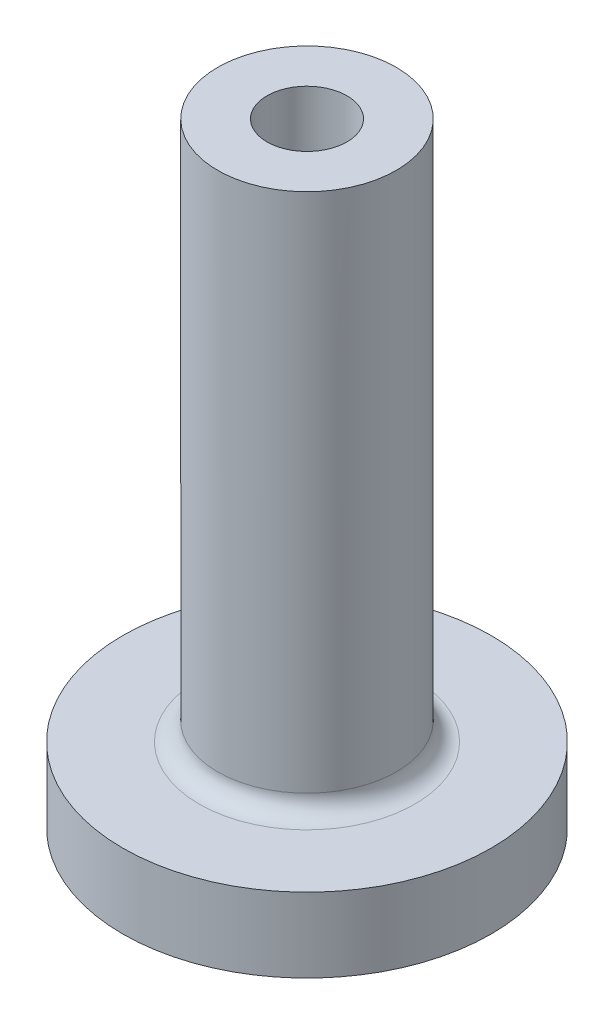
ISO-10303-21;
HEADER;
FILE_DESCRIPTION(('STEP AP214'),'2;1');
FILE_NAME('part.step','',(''),(''),'','','');
FILE_SCHEMA(('AUTOMOTIVE_DESIGN { 1 0 10303 214 1 1 1 1 }'));
ENDSEC;
DATA;
#1=APPLICATION_CONTEXT('core data for automotive mechanical design processes');
#2=APPLICATION_PROTOCOL_DEFINITION('international standard','automotive_design',2000,#1);
#3=PRODUCT_CONTEXT('',#1,'mechanical');
#4=PRODUCT('Part','Part','',(#3));
#5=PRODUCT_RELATED_PRODUCT_CATEGORY('part','',(#4));
#6=PRODUCT_DEFINITION_FORMATION('','',#4);
#7=PRODUCT_DEFINITION_CONTEXT('part definition',#1,'design');
#8=PRODUCT_DEFINITION('design','',#6,#7);
#9=PRODUCT_DEFINITION_SHAPE('','',#8);
#10=(LENGTH_UNIT() NAMED_UNIT(*) SI_UNIT(.MILLI.,.METRE.));
#11=(NAMED_UNIT(*) PLANE_ANGLE_UNIT() SI_UNIT($,.RADIAN.));
#12=(NAMED_UNIT(*) SI_UNIT($,.STERADIAN.) SOLID_ANGLE_UNIT());
#13=UNCERTAINTY_MEASURE_WITH_UNIT(LENGTH_MEASURE(1.E-05),#10,'distance_accuracy_value','');
#14=(GEOMETRIC_REPRESENTATION_CONTEXT(3) GLOBAL_UNCERTAINTY_ASSIGNED_CONTEXT((#13)) GLOBAL_UNIT_ASSIGNED_CONTEXT((#10,
#11,#12)) REPRESENTATION_CONTEXT('',''));
#15=CARTESIAN_POINT('',(0.,0.,0.));
#16=DIRECTION('',(0.,0.,1.));
#17=DIRECTION('',(1.,0.,0.));
#18=AXIS2_PLACEMENT_3D('',#15,#16,#17);
#19=CARTESIAN_POINT('',(0.,4.,0.));
#20=DIRECTION('',(0.,-1.,0.));
#21=DIRECTION('',(0.,0.,-1.));
#22=AXIS2_PLACEMENT_3D('',#19,#20,#21);
#23=CYLINDRICAL_SURFACE('',#22,9.9);
#24=CARTESIAN_POINT('',(0.,4.,0.));
#25=DIRECTION('',(0.,1.,0.));
#26=DIRECTION('',(0.,0.,1.));
#27=AXIS2_PLACEMENT_3D('',#24,#25,#26);
#28=CIRCLE('',#27,9.9);
#29=CARTESIAN_POINT('',(0.,4.,9.9));
#30=VERTEX_POINT('',#29);
#31=EDGE_CURVE('E50',#30,#30,#28,.T.);
#32=ORIENTED_EDGE('',*,*,#31,.F.);
#33=EDGE_LOOP('',(#32));
#34=FACE_BOUND('',#33,.T.);
#35=CARTESIAN_POINT('',(0.,0.,0.));
#36=DIRECTION('',(0.,1.,0.));
#37=DIRECTION('',(0.,0.,1.));
#38=AXIS2_PLACEMENT_3D('',#35,#36,#37);
#39=CIRCLE('',#38,9.9);
#40=CARTESIAN_POINT('',(0.,0.,9.9));
#41=VERTEX_POINT('',#40);
#42=EDGE_CURVE('E54',#41,#41,#39,.T.);
#43=ORIENTED_EDGE('',*,*,#42,.T.);
#44=EDGE_LOOP('',(#43));
#45=FACE_BOUND('',#44,.T.);
#46=ADVANCED_FACE('F39',(#34,#45),#23,.T.);
#47=CARTESIAN_POINT('',(0.,4.,0.));
#48=DIRECTION('',(0.,1.,0.));
#49=DIRECTION('',(0.,0.,1.));
#50=AXIS2_PLACEMENT_3D('',#47,#48,#49);
#51=PLANE('',#50);
#52=CARTESIAN_POINT('',(0.,4.,0.));
#53=DIRECTION('',(0.,1.,0.));
#54=DIRECTION('',(0.,0.,1.));
#55=AXIS2_PLACEMENT_3D('',#52,#53,#54);
#56=CIRCLE('',#55,5.8);
#57=CARTESIAN_POINT('',(0.,4.,5.8));
#58=VERTEX_POINT('',#57);
#59=EDGE_CURVE('E10',#58,#58,#56,.F.);
#60=ORIENTED_EDGE('',*,*,#59,.T.);
#61=EDGE_LOOP('',(#60));
#62=FACE_BOUND('',#61,.T.);
#63=ORIENTED_EDGE('',*,*,#31,.T.);
#64=EDGE_LOOP('',(#63));
#65=FACE_BOUND('',#64,.T.);
#66=ADVANCED_FACE('F92',(#62,#65),#51,.T.);
#67=CARTESIAN_POINT('',(0.,0.,0.));
#68=DIRECTION('',(0.,1.,0.));
#69=DIRECTION('',(0.,0.,1.));
#70=AXIS2_PLACEMENT_3D('',#67,#68,#69);
#71=PLANE('',#70);
#72=ORIENTED_EDGE('',*,*,#42,.F.);
#73=EDGE_LOOP('',(#72));
#74=FACE_BOUND('',#73,.T.);
#75=ADVANCED_FACE('F85',(#74),#71,.F.);
#76=CARTESIAN_POINT('',(0.,33.,0.));
#77=DIRECTION('',(0.,-1.,0.));
#78=DIRECTION('',(0.,0.,-1.));
#79=AXIS2_PLACEMENT_3D('',#76,#77,#78);
#80=CYLINDRICAL_SURFACE('',#79,4.8);
#81=CARTESIAN_POINT('',(0.,5.,0.));
#82=DIRECTION('',(0.,1.,0.));
#83=DIRECTION('',(0.,0.,1.));
#84=AXIS2_PLACEMENT_3D('',#81,#82,#83);
#85=CIRCLE('',#84,4.8);
#86=CARTESIAN_POINT('',(0.,5.,-4.8));
#87=VERTEX_POINT('',#86);
#88=EDGE_CURVE('E46',#87,#87,#85,.T.);
#89=CARTESIAN_POINT('',(0.,33.,0.));
#90=DIRECTION('',(0.,1.,0.));
#91=DIRECTION('',(0.,0.,1.));
#92=AXIS2_PLACEMENT_3D('',#89,#90,#91);
#93=CIRCLE('',#92,4.8);
#94=CARTESIAN_POINT('',(0.,33.,-4.8));
#95=VERTEX_POINT('',#94);
#96=EDGE_CURVE('E58',#95,#95,#93,.T.);
#97=CARTESIAN_POINT('',(0.,5.,-4.8));
#98=CARTESIAN_POINT('',(0.,5.29166666666667,-4.8));
#99=CARTESIAN_POINT('',(0.,5.58333333333333,-4.8));
#100=CARTESIAN_POINT('',(0.,6.16666666666667,-4.8));
#101=CARTESIAN_POINT('',(0.,6.45833333333334,-4.8));
#102=CARTESIAN_POINT('',(0.,7.04166666666667,-4.8));
#103=CARTESIAN_POINT('',(0.,7.33333333333333,-4.8));
#104=CARTESIAN_POINT('',(0.,7.91666666666667,-4.8));
#105=CARTESIAN_POINT('',(0.,8.20833333333333,-4.8));
#106=CARTESIAN_POINT('',(0.,8.79166666666667,-4.8));
#107=CARTESIAN_POINT('',(0.,9.08333333333333,-4.8));
#108=CARTESIAN_POINT('',(0.,9.66666666666667,-4.8));
#109=CARTESIAN_POINT('',(0.,9.95833333333333,-4.8));
#110=CARTESIAN_POINT('',(0.,10.5416666666667,-4.8));
#111=CARTESIAN_POINT('',(0.,10.8333333333333,-4.8));
#112=CARTESIAN_POINT('',(0.,11.4166666666667,-4.8));
#113=CARTESIAN_POINT('',(0.,11.7083333333333,-4.8));
#114=CARTESIAN_POINT('',(0.,12.2916666666667,-4.8));
#115=CARTESIAN_POINT('',(0.,12.5833333333333,-4.8));
#116=CARTESIAN_POINT('',(0.,13.1666666666667,-4.8));
#117=CARTESIAN_POINT('',(0.,13.4583333333333,-4.8));
#118=CARTESIAN_POINT('',(0.,14.0416666666667,-4.8));
#119=CARTESIAN_POINT('',(0.,14.3333333333333,-4.8));
#120=CARTESIAN_POINT('',(0.,14.9166666666667,-4.8));
#121=CARTESIAN_POINT('',(0.,15.2083333333333,-4.8));
#122=CARTESIAN_POINT('',(0.,15.7916666666667,-4.8));
#123=CARTESIAN_POINT('',(0.,16.0833333333333,-4.8));
#124=CARTESIAN_POINT('',(0.,16.6666666666667,-4.8));
#125=CARTESIAN_POINT('',(0.,16.9583333333333,-4.8));
#126=CARTESIAN_POINT('',(0.,17.5416666666667,-4.8));
#127=CARTESIAN_POINT('',(0.,17.8333333333333,-4.8));
#128=CARTESIAN_POINT('',(0.,18.4166666666667,-4.8));
#129=CARTESIAN_POINT('',(0.,18.7083333333333,-4.8));
#130=CARTESIAN_POINT('',(0.,19.2916666666667,-4.8));
#131=CARTESIAN_POINT('',(0.,19.5833333333333,-4.8));
#132=CARTESIAN_POINT('',(0.,20.1666666666667,-4.8));
#133=CARTESIAN_POINT('',(0.,20.4583333333333,-4.8));
#134=CARTESIAN_POINT('',(0.,21.0416666666667,-4.8));
#135=CARTESIAN_POINT('',(0.,21.3333333333333,-4.8));
#136=CARTESIAN_POINT('',(0.,21.9166666666667,-4.8));
#137=CARTESIAN_POINT('',(0.,22.2083333333333,-4.8));
#138=CARTESIAN_POINT('',(0.,22.7916666666667,-4.8));
#139=CARTESIAN_POINT('',(0.,23.0833333333333,-4.8));
#140=CARTESIAN_POINT('',(0.,23.6666666666667,-4.8));
#141=CARTESIAN_POINT('',(0.,23.9583333333333,-4.8));
#142=CARTESIAN_POINT('',(0.,24.5416666666667,-4.8));
#143=CARTESIAN_POINT('',(0.,24.8333333333333,-4.8));
#144=CARTESIAN_POINT('',(0.,25.4166666666667,-4.8));
#145=CARTESIAN_POINT('',(0.,25.7083333333333,-4.8));
#146=CARTESIAN_POINT('',(0.,26.2916666666667,-4.8));
#147=CARTESIAN_POINT('',(0.,26.5833333333333,-4.8));
#148=CARTESIAN_POINT('',(0.,27.1666666666667,-4.8));
#149=CARTESIAN_POINT('',(0.,27.4583333333333,-4.8));
#150=CARTESIAN_POINT('',(0.,28.0416666666667,-4.8));
#151=CARTESIAN_POINT('',(0.,28.3333333333333,-4.8));
#152=CARTESIAN_POINT('',(0.,28.9166666666667,-4.8));
#153=CARTESIAN_POINT('',(0.,29.2083333333333,-4.8));
#154=CARTESIAN_POINT('',(0.,29.7916666666667,-4.8));
#155=CARTESIAN_POINT('',(0.,30.0833333333333,-4.8));
#156=CARTESIAN_POINT('',(0.,30.6666666666667,-4.8));
#157=CARTESIAN_POINT('',(0.,30.9583333333333,-4.8));
#158=CARTESIAN_POINT('',(0.,31.5416666666667,-4.8));
#159=CARTESIAN_POINT('',(0.,31.8333333333333,-4.8));
#160=CARTESIAN_POINT('',(0.,32.4166666666667,-4.8));
#161=CARTESIAN_POINT('',(0.,32.7083333333333,-4.8));
#162=CARTESIAN_POINT('',(0.,33.,-4.8));
#163=B_SPLINE_CURVE_WITH_KNOTS('',3,(#97,#98,#99,#100,#101,#102,#103,#104,#105,#106,#107,#108,
#109,#110,#111,#112,#113,#114,#115,#116,#117,#118,#119,#120,#121,#122,#123,#124,#125,#126,#127,
#128,#129,#130,#131,#132,#133,#134,#135,#136,#137,#138,#139,#140,#141,#142,#143,#144,#145,#146,
#147,#148,#149,#150,#151,#152,#153,#154,#155,#156,#157,#158,#159,#160,#161,#162),.UNSPECIFIED.,
.F.,.F.,(4,2,2,2,2,2,2,2,2,2,2,2,2,2,2,2,2,2,2,2,2,2,2,2,2,2,2,2,2,2,2,2,4),(0.,
0.875000000000001,1.75,2.625,3.5,4.375,5.25,6.125,7.,7.875,8.75,9.625,10.5,11.375,12.25,13.125,
14.,14.875,15.75,16.625,17.5,18.375,19.25,20.125,21.,21.875,22.75,23.625,24.5,25.375,26.25,
27.125,28.),.UNSPECIFIED.);
#164=EDGE_CURVE('BSEAM80',#87,#95,#163,.T.);
#165=ORIENTED_EDGE('',*,*,#88,.T.);
#166=ORIENTED_EDGE('',*,*,#96,.F.);
#167=ORIENTED_EDGE('',*,*,#164,.T.);
#168=ORIENTED_EDGE('',*,*,#164,.F.);
#169=EDGE_LOOP('',(#165,#167,#166,#168));
#170=FACE_BOUND('',#169,.T.);
#171=ADVANCED_FACE('F80',(#170),#80,.T.);
#172=CARTESIAN_POINT('',(0.,33.,0.));
#173=DIRECTION('',(0.,1.,0.));
#174=DIRECTION('',(0.,0.,1.));
#175=AXIS2_PLACEMENT_3D('',#172,#173,#174);
#176=PLANE('',#175);
#177=CARTESIAN_POINT('',(0.,33.,0.));
#178=DIRECTION('',(0.,1.,0.));
#179=DIRECTION('',(0.,0.,1.));
#180=AXIS2_PLACEMENT_3D('',#177,#178,#179);
#181=CIRCLE('',#180,2.15);
#182=CARTESIAN_POINT('',(0.,33.,2.15));
#183=VERTEX_POINT('',#182);
#184=EDGE_CURVE('E63',#183,#183,#181,.T.);
#185=ORIENTED_EDGE('',*,*,#184,.F.);
#186=EDGE_LOOP('',(#185));
#187=FACE_BOUND('',#186,.T.);
#188=ORIENTED_EDGE('',*,*,#96,.T.);
#189=EDGE_LOOP('',(#188));
#190=FACE_BOUND('',#189,.T.);
#191=ADVANCED_FACE('F74',(#187,#190),#176,.T.);
#192=CARTESIAN_POINT('',(0.,25.,0.));
#193=DIRECTION('',(0.,1.,0.));
#194=DIRECTION('',(0.,0.,1.));
#195=AXIS2_PLACEMENT_3D('',#192,#193,#194);
#196=CYLINDRICAL_SURFACE('',#195,2.15);
#197=CARTESIAN_POINT('',(0.,25.,0.));
#198=DIRECTION('',(0.,1.,0.));
#199=DIRECTION('',(0.,0.,1.));
#200=AXIS2_PLACEMENT_3D('',#197,#198,#199);
#201=CIRCLE('',#200,2.15);
#202=CARTESIAN_POINT('',(0.,25.,2.15));
#203=VERTEX_POINT('',#202);
#204=EDGE_CURVE('E62',#203,#203,#201,.T.);
#205=ORIENTED_EDGE('',*,*,#204,.F.);
#206=EDGE_LOOP('',(#205));
#207=FACE_BOUND('',#206,.T.);
#208=ORIENTED_EDGE('',*,*,#184,.T.);
#209=EDGE_LOOP('',(#208));
#210=FACE_BOUND('',#209,.T.);
#211=ADVANCED_FACE('F71',(#207,#210),#196,.F.);
#212=CARTESIAN_POINT('',(0.,25.,0.));
#213=DIRECTION('',(0.,1.,0.));
#214=DIRECTION('',(0.,0.,1.));
#215=AXIS2_PLACEMENT_3D('',#212,#213,#214);
#216=PLANE('',#215);
#217=ORIENTED_EDGE('',*,*,#204,.T.);
#218=EDGE_LOOP('',(#217));
#219=FACE_BOUND('',#218,.T.);
#220=ADVANCED_FACE('F69',(#219),#216,.T.);
#221=CARTESIAN_POINT('',(0.,5.,0.));
#222=DIRECTION('',(0.,1.,0.));
#223=DIRECTION('',(0.,0.,1.));
#224=AXIS2_PLACEMENT_3D('',#221,#222,#223);
#225=TOROIDAL_SURFACE('',#224,5.8,1.);
#226=ORIENTED_EDGE('',*,*,#59,.F.);
#227=EDGE_LOOP('',(#226));
#228=FACE_BOUND('',#227,.T.);
#229=ORIENTED_EDGE('',*,*,#88,.F.);
#230=EDGE_LOOP('',(#229));
#231=FACE_BOUND('',#230,.T.);
#232=ADVANCED_FACE('F41',(#228,#231),#225,.F.);
#233=CLOSED_SHELL('',(#46,#66,#75,#171,#191,#211,#220,#232));
#234=MANIFOLD_SOLID_BREP('B2',#233);
#235=ADVANCED_BREP_SHAPE_REPRESENTATION('',(#18,#234),#14);
#236=SHAPE_DEFINITION_REPRESENTATION(#9,#235);
ENDSEC;
END-ISO-10303-21;
